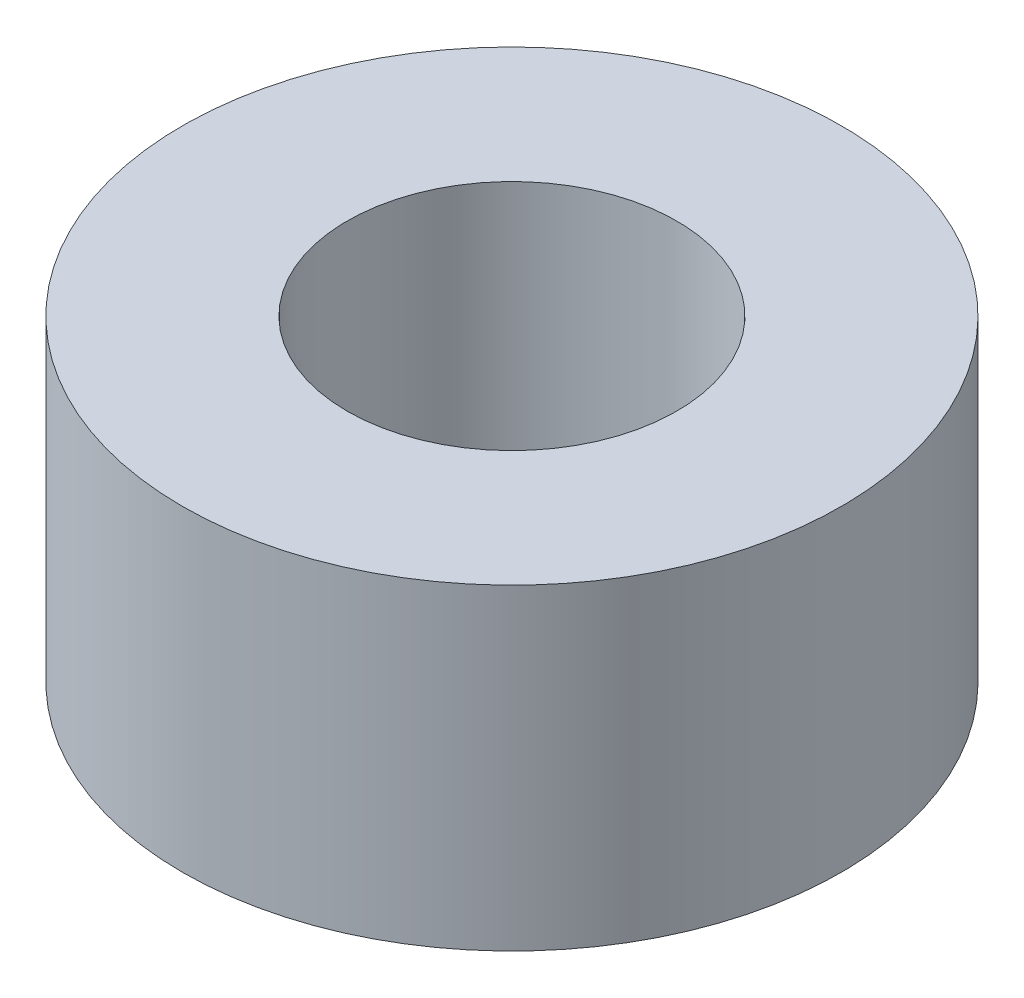
ISO-10303-21;
HEADER;
FILE_DESCRIPTION(('STEP AP214'),'2;1');
FILE_NAME('part.step','',(''),(''),'','','');
FILE_SCHEMA(('AUTOMOTIVE_DESIGN { 1 0 10303 214 1 1 1 1 }'));
ENDSEC;
DATA;
#1=APPLICATION_CONTEXT('core data for automotive mechanical design processes');
#2=APPLICATION_PROTOCOL_DEFINITION('international standard','automotive_design',2000,#1);
#3=PRODUCT_CONTEXT('',#1,'mechanical');
#4=PRODUCT('Part','Part','',(#3));
#5=PRODUCT_RELATED_PRODUCT_CATEGORY('part','',(#4));
#6=PRODUCT_DEFINITION_FORMATION('','',#4);
#7=PRODUCT_DEFINITION_CONTEXT('part definition',#1,'design');
#8=PRODUCT_DEFINITION('design','',#6,#7);
#9=PRODUCT_DEFINITION_SHAPE('','',#8);
#10=(LENGTH_UNIT() NAMED_UNIT(*) SI_UNIT(.MILLI.,.METRE.));
#11=(NAMED_UNIT(*) PLANE_ANGLE_UNIT() SI_UNIT($,.RADIAN.));
#12=(NAMED_UNIT(*) SI_UNIT($,.STERADIAN.) SOLID_ANGLE_UNIT());
#13=UNCERTAINTY_MEASURE_WITH_UNIT(LENGTH_MEASURE(1.E-05),#10,'distance_accuracy_value','');
#14=(GEOMETRIC_REPRESENTATION_CONTEXT(3) GLOBAL_UNCERTAINTY_ASSIGNED_CONTEXT((#13)) GLOBAL_UNIT_ASSIGNED_CONTEXT((#10,
#11,#12)) REPRESENTATION_CONTEXT('',''));
#15=CARTESIAN_POINT('',(0.,0.,0.));
#16=DIRECTION('',(0.,0.,1.));
#17=DIRECTION('',(1.,0.,0.));
#18=AXIS2_PLACEMENT_3D('',#15,#16,#17);
#19=CARTESIAN_POINT('',(0.,3.175,0.));
#20=DIRECTION('',(0.,1.,0.));
#21=DIRECTION('',(0.,0.,1.));
#22=AXIS2_PLACEMENT_3D('',#19,#20,#21);
#23=PLANE('',#22);
#24=CARTESIAN_POINT('',(0.,3.175,0.));
#25=DIRECTION('',(0.,1.,0.));
#26=DIRECTION('',(0.,0.,1.));
#27=AXIS2_PLACEMENT_3D('',#24,#25,#26);
#28=CIRCLE('',#27,3.302);
#29=CARTESIAN_POINT('',(0.,3.175,3.302));
#30=VERTEX_POINT('',#29);
#31=EDGE_CURVE('E10',#30,#30,#28,.T.);
#32=ORIENTED_EDGE('',*,*,#31,.T.);
#33=EDGE_LOOP('',(#32));
#34=FACE_BOUND('',#33,.T.);
#35=CARTESIAN_POINT('',(0.,3.175,0.));
#36=DIRECTION('',(0.,1.,0.));
#37=DIRECTION('',(0.,0.,1.));
#38=AXIS2_PLACEMENT_3D('',#35,#36,#37);
#39=CIRCLE('',#38,1.651);
#40=CARTESIAN_POINT('',(0.,3.175,1.651));
#41=VERTEX_POINT('',#40);
#42=EDGE_CURVE('E48',#41,#41,#39,.T.);
#43=ORIENTED_EDGE('',*,*,#42,.F.);
#44=EDGE_LOOP('',(#43));
#45=FACE_BOUND('',#44,.T.);
#46=ADVANCED_FACE('F37',(#34,#45),#23,.T.);
#47=CARTESIAN_POINT('',(0.,0.,0.));
#48=DIRECTION('',(0.,1.,0.));
#49=DIRECTION('',(0.,0.,1.));
#50=AXIS2_PLACEMENT_3D('',#47,#48,#49);
#51=PLANE('',#50);
#52=CARTESIAN_POINT('',(0.,0.,0.));
#53=DIRECTION('',(0.,1.,0.));
#54=DIRECTION('',(0.,0.,1.));
#55=AXIS2_PLACEMENT_3D('',#52,#53,#54);
#56=CIRCLE('',#55,3.302);
#57=CARTESIAN_POINT('',(0.,0.,3.302));
#58=VERTEX_POINT('',#57);
#59=EDGE_CURVE('E41',#58,#58,#56,.T.);
#60=ORIENTED_EDGE('',*,*,#59,.F.);
#61=EDGE_LOOP('',(#60));
#62=FACE_BOUND('',#61,.T.);
#63=CARTESIAN_POINT('',(0.,0.,0.));
#64=DIRECTION('',(0.,1.,0.));
#65=DIRECTION('',(0.,0.,1.));
#66=AXIS2_PLACEMENT_3D('',#63,#64,#65);
#67=CIRCLE('',#66,1.651);
#68=CARTESIAN_POINT('',(0.,0.,1.651));
#69=VERTEX_POINT('',#68);
#70=EDGE_CURVE('E50',#69,#69,#67,.T.);
#71=ORIENTED_EDGE('',*,*,#70,.T.);
#72=EDGE_LOOP('',(#71));
#73=FACE_BOUND('',#72,.T.);
#74=ADVANCED_FACE('F60',(#62,#73),#51,.F.);
#75=CARTESIAN_POINT('',(0.,3.175,0.));
#76=DIRECTION('',(0.,-1.,0.));
#77=DIRECTION('',(0.,0.,-1.));
#78=AXIS2_PLACEMENT_3D('',#75,#76,#77);
#79=CYLINDRICAL_SURFACE('',#78,3.302);
#80=ORIENTED_EDGE('',*,*,#31,.F.);
#81=EDGE_LOOP('',(#80));
#82=FACE_BOUND('',#81,.T.);
#83=ORIENTED_EDGE('',*,*,#59,.T.);
#84=EDGE_LOOP('',(#83));
#85=FACE_BOUND('',#84,.T.);
#86=ADVANCED_FACE('F39',(#82,#85),#79,.T.);
#87=CARTESIAN_POINT('',(0.,3.175,0.));
#88=DIRECTION('',(0.,-1.,0.));
#89=DIRECTION('',(0.,0.,-1.));
#90=AXIS2_PLACEMENT_3D('',#87,#88,#89);
#91=CYLINDRICAL_SURFACE('',#90,1.651);
#92=ORIENTED_EDGE('',*,*,#42,.T.);
#93=EDGE_LOOP('',(#92));
#94=FACE_BOUND('',#93,.T.);
#95=ORIENTED_EDGE('',*,*,#70,.F.);
#96=EDGE_LOOP('',(#95));
#97=FACE_BOUND('',#96,.T.);
#98=ADVANCED_FACE('F56',(#94,#97),#91,.F.);
#99=CLOSED_SHELL('',(#46,#74,#86,#98));
#100=MANIFOLD_SOLID_BREP('B2',#99);
#101=ADVANCED_BREP_SHAPE_REPRESENTATION('',(#18,#100),#14);
#102=SHAPE_DEFINITION_REPRESENTATION(#9,#101);
ENDSEC;
END-ISO-10303-21;
